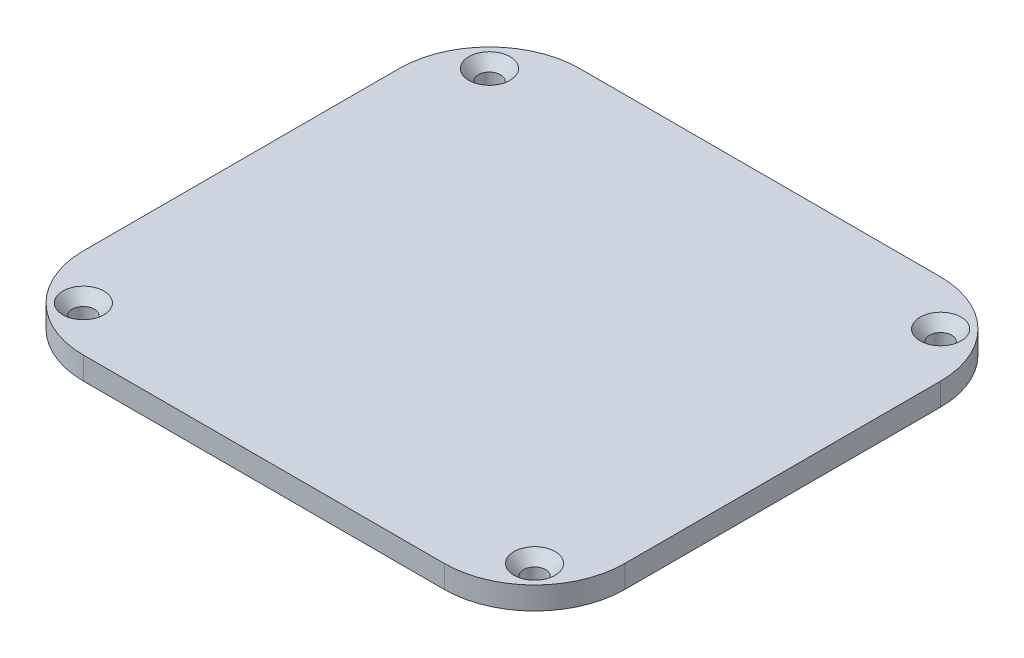
ISO-10303-21;
HEADER;
FILE_DESCRIPTION(('STEP AP214'),'2;1');
FILE_NAME('part.step','',(''),(''),'','','');
FILE_SCHEMA(('AUTOMOTIVE_DESIGN { 1 0 10303 214 1 1 1 1 }'));
ENDSEC;
DATA;
#1=APPLICATION_CONTEXT('core data for automotive mechanical design processes');
#2=APPLICATION_PROTOCOL_DEFINITION('international standard','automotive_design',2000,#1);
#3=PRODUCT_CONTEXT('',#1,'mechanical');
#4=PRODUCT('Part','Part','',(#3));
#5=PRODUCT_RELATED_PRODUCT_CATEGORY('part','',(#4));
#6=PRODUCT_DEFINITION_FORMATION('','',#4);
#7=PRODUCT_DEFINITION_CONTEXT('part definition',#1,'design');
#8=PRODUCT_DEFINITION('design','',#6,#7);
#9=PRODUCT_DEFINITION_SHAPE('','',#8);
#10=(LENGTH_UNIT() NAMED_UNIT(*) SI_UNIT(.MILLI.,.METRE.));
#11=(NAMED_UNIT(*) PLANE_ANGLE_UNIT() SI_UNIT($,.RADIAN.));
#12=(NAMED_UNIT(*) SI_UNIT($,.STERADIAN.) SOLID_ANGLE_UNIT());
#13=UNCERTAINTY_MEASURE_WITH_UNIT(LENGTH_MEASURE(1.E-05),#10,'distance_accuracy_value','');
#14=(GEOMETRIC_REPRESENTATION_CONTEXT(3) GLOBAL_UNCERTAINTY_ASSIGNED_CONTEXT((#13)) GLOBAL_UNIT_ASSIGNED_CONTEXT((#10,
#11,#12)) REPRESENTATION_CONTEXT('',''));
#15=CARTESIAN_POINT('',(0.,0.,0.));
#16=DIRECTION('',(0.,0.,1.));
#17=DIRECTION('',(1.,0.,0.));
#18=AXIS2_PLACEMENT_3D('',#15,#16,#17);
#19=CARTESIAN_POINT('',(-40.,0.,30.));
#20=DIRECTION('',(0.,-1.,0.));
#21=DIRECTION('',(0.,0.,-1.));
#22=AXIS2_PLACEMENT_3D('',#19,#20,#21);
#23=PLANE('',#22);
#24=CARTESIAN_POINT('',(50.,0.,40.));
#25=DIRECTION('',(0.,-1.,0.));
#26=DIRECTION('',(0.,0.,-1.));
#27=AXIS2_PLACEMENT_3D('',#24,#25,#26);
#28=CIRCLE('',#27,2.45744999999999);
#29=CARTESIAN_POINT('',(50.,0.,37.54255));
#30=VERTEX_POINT('',#29);
#31=EDGE_CURVE('E41',#30,#30,#28,.T.);
#32=ORIENTED_EDGE('',*,*,#31,.F.);
#33=EDGE_LOOP('',(#32));
#34=FACE_BOUND('',#33,.T.);
#35=CARTESIAN_POINT('',(50.,0.,-50.));
#36=DIRECTION('',(0.,-1.,0.));
#37=DIRECTION('',(0.,0.,-1.));
#38=AXIS2_PLACEMENT_3D('',#35,#36,#37);
#39=CIRCLE('',#38,2.45744999999999);
#40=CARTESIAN_POINT('',(50.,0.,-52.45745));
#41=VERTEX_POINT('',#40);
#42=EDGE_CURVE('E333',#41,#41,#39,.T.);
#43=ORIENTED_EDGE('',*,*,#42,.F.);
#44=EDGE_LOOP('',(#43));
#45=FACE_BOUND('',#44,.T.);
#46=CARTESIAN_POINT('',(-50.,0.,-50.));
#47=DIRECTION('',(0.,-1.,0.));
#48=DIRECTION('',(0.,0.,-1.));
#49=AXIS2_PLACEMENT_3D('',#46,#47,#48);
#50=CIRCLE('',#49,2.45744999999999);
#51=CARTESIAN_POINT('',(-50.,0.,-52.45745));
#52=VERTEX_POINT('',#51);
#53=EDGE_CURVE('E329',#52,#52,#50,.T.);
#54=ORIENTED_EDGE('',*,*,#53,.F.);
#55=EDGE_LOOP('',(#54));
#56=FACE_BOUND('',#55,.T.);
#57=CARTESIAN_POINT('',(-50.,0.,40.));
#58=DIRECTION('',(0.,-1.,0.));
#59=DIRECTION('',(0.,0.,-1.));
#60=AXIS2_PLACEMENT_3D('',#57,#58,#59);
#61=CIRCLE('',#60,2.45744999999999);
#62=CARTESIAN_POINT('',(-50.,0.,37.54255));
#63=VERTEX_POINT('',#62);
#64=EDGE_CURVE('E324',#63,#63,#61,.T.);
#65=ORIENTED_EDGE('',*,*,#64,.F.);
#66=EDGE_LOOP('',(#65));
#67=FACE_BOUND('',#66,.T.);
#68=CARTESIAN_POINT('',(27.44,0.,-12.83));
#69=DIRECTION('',(0.,-1.,0.));
#70=DIRECTION('',(0.,0.,-1.));
#71=AXIS2_PLACEMENT_3D('',#68,#69,#70);
#72=CIRCLE('',#71,4.9);
#73=CARTESIAN_POINT('',(27.44,0.,-17.73));
#74=VERTEX_POINT('',#73);
#75=EDGE_CURVE('E327',#74,#74,#72,.T.);
#76=ORIENTED_EDGE('',*,*,#75,.F.);
#77=EDGE_LOOP('',(#76));
#78=FACE_BOUND('',#77,.T.);
#79=CARTESIAN_POINT('',(44.41,0.,4.14000000000001));
#80=DIRECTION('',(0.,-1.,0.));
#81=DIRECTION('',(0.,0.,-1.));
#82=AXIS2_PLACEMENT_3D('',#79,#80,#81);
#83=CIRCLE('',#82,4.9);
#84=CARTESIAN_POINT('',(44.41,0.,-0.759999999999998));
#85=VERTEX_POINT('',#84);
#86=EDGE_CURVE('E359',#85,#85,#83,.T.);
#87=ORIENTED_EDGE('',*,*,#86,.F.);
#88=EDGE_LOOP('',(#87));
#89=FACE_BOUND('',#88,.T.);
#90=CARTESIAN_POINT('',(3.43999999999999,0.,-12.83));
#91=DIRECTION('',(0.,-1.,0.));
#92=DIRECTION('',(0.,0.,-1.));
#93=AXIS2_PLACEMENT_3D('',#90,#91,#92);
#94=CIRCLE('',#93,4.9);
#95=CARTESIAN_POINT('',(3.43999999999999,0.,-17.73));
#96=VERTEX_POINT('',#95);
#97=EDGE_CURVE('E365',#96,#96,#94,.T.);
#98=ORIENTED_EDGE('',*,*,#97,.F.);
#99=EDGE_LOOP('',(#98));
#100=FACE_BOUND('',#99,.T.);
#101=CARTESIAN_POINT('',(-43.84,0.,2.83));
#102=DIRECTION('',(0.,-1.,0.));
#103=DIRECTION('',(0.,0.,-1.));
#104=AXIS2_PLACEMENT_3D('',#101,#102,#103);
#105=CIRCLE('',#104,4.9);
#106=CARTESIAN_POINT('',(-43.84,0.,-2.07));
#107=VERTEX_POINT('',#106);
#108=EDGE_CURVE('E371',#107,#107,#105,.T.);
#109=ORIENTED_EDGE('',*,*,#108,.F.);
#110=EDGE_LOOP('',(#109));
#111=FACE_BOUND('',#110,.T.);
#112=CARTESIAN_POINT('',(-20.2,0.,7.00000000000001));
#113=DIRECTION('',(0.,-1.,0.));
#114=DIRECTION('',(0.,0.,-1.));
#115=AXIS2_PLACEMENT_3D('',#112,#113,#114);
#116=CIRCLE('',#115,4.9);
#117=CARTESIAN_POINT('',(-20.2,0.,2.1));
#118=VERTEX_POINT('',#117);
#119=EDGE_CURVE('E377',#118,#118,#116,.T.);
#120=ORIENTED_EDGE('',*,*,#119,.F.);
#121=EDGE_LOOP('',(#120));
#122=FACE_BOUND('',#121,.T.);
#123=DIRECTION('',(-1.,0.,0.));
#124=VECTOR('',#123,1.);
#125=CARTESIAN_POINT('',(40.,0.,50.));
#126=LINE('',#125,#124);
#127=CARTESIAN_POINT('',(40.,0.,50.));
#128=VERTEX_POINT('',#127);
#129=CARTESIAN_POINT('',(-40.,0.,50.));
#130=VERTEX_POINT('',#129);
#131=EDGE_CURVE('E253',#128,#130,#126,.T.);
#132=ORIENTED_EDGE('',*,*,#131,.T.);
#133=CARTESIAN_POINT('',(-40.,0.,30.));
#134=DIRECTION('',(0.,-1.,0.));
#135=DIRECTION('',(0.,0.,-1.));
#136=AXIS2_PLACEMENT_3D('',#133,#134,#135);
#137=CIRCLE('',#136,20.);
#138=CARTESIAN_POINT('',(-60.,0.,30.));
#139=VERTEX_POINT('',#138);
#140=EDGE_CURVE('E292',#130,#139,#137,.T.);
#141=ORIENTED_EDGE('',*,*,#140,.T.);
#142=DIRECTION('',(0.,0.,-1.));
#143=VECTOR('',#142,1.);
#144=CARTESIAN_POINT('',(-60.,0.,30.));
#145=LINE('',#144,#143);
#146=CARTESIAN_POINT('',(-60.,0.,-40.));
#147=VERTEX_POINT('',#146);
#148=EDGE_CURVE('E295',#139,#147,#145,.T.);
#149=ORIENTED_EDGE('',*,*,#148,.T.);
#150=CARTESIAN_POINT('',(-40.,0.,-40.));
#151=DIRECTION('',(0.,-1.,0.));
#152=DIRECTION('',(0.,0.,-1.));
#153=AXIS2_PLACEMENT_3D('',#150,#151,#152);
#154=CIRCLE('',#153,20.);
#155=CARTESIAN_POINT('',(-40.,0.,-60.));
#156=VERTEX_POINT('',#155);
#157=EDGE_CURVE('E298',#147,#156,#154,.T.);
#158=ORIENTED_EDGE('',*,*,#157,.T.);
#159=DIRECTION('',(1.,0.,0.));
#160=VECTOR('',#159,1.);
#161=CARTESIAN_POINT('',(-40.,0.,-60.));
#162=LINE('',#161,#160);
#163=CARTESIAN_POINT('',(40.,0.,-60.));
#164=VERTEX_POINT('',#163);
#165=EDGE_CURVE('E301',#156,#164,#162,.T.);
#166=ORIENTED_EDGE('',*,*,#165,.T.);
#167=CARTESIAN_POINT('',(40.,0.,-40.));
#168=DIRECTION('',(0.,1.,0.));
#169=DIRECTION('',(0.,0.,1.));
#170=AXIS2_PLACEMENT_3D('',#167,#168,#169);
#171=CIRCLE('',#170,20.);
#172=CARTESIAN_POINT('',(60.,0.,-40.));
#173=VERTEX_POINT('',#172);
#174=EDGE_CURVE('E304',#173,#164,#171,.T.);
#175=ORIENTED_EDGE('',*,*,#174,.F.);
#176=DIRECTION('',(0.,0.,1.));
#177=VECTOR('',#176,1.);
#178=CARTESIAN_POINT('',(60.,0.,-40.));
#179=LINE('',#178,#177);
#180=CARTESIAN_POINT('',(60.,0.,30.));
#181=VERTEX_POINT('',#180);
#182=EDGE_CURVE('E307',#173,#181,#179,.T.);
#183=ORIENTED_EDGE('',*,*,#182,.T.);
#184=CARTESIAN_POINT('',(40.,0.,30.));
#185=DIRECTION('',(0.,-1.,0.));
#186=DIRECTION('',(0.,0.,-1.));
#187=AXIS2_PLACEMENT_3D('',#184,#185,#186);
#188=CIRCLE('',#187,20.);
#189=EDGE_CURVE('E269',#181,#128,#188,.T.);
#190=ORIENTED_EDGE('',*,*,#189,.T.);
#191=EDGE_LOOP('',(#132,#141,#149,#158,#166,#175,#183,#190));
#192=FACE_BOUND('',#191,.T.);
#193=DIRECTION('',(1.,0.,0.));
#194=VECTOR('',#193,1.);
#195=CARTESIAN_POINT('',(0.,0.,-30.6));
#196=LINE('',#195,#194);
#197=CARTESIAN_POINT('',(3.09999999999999,0.,-30.6));
#198=VERTEX_POINT('',#197);
#199=CARTESIAN_POINT('',(41.9,0.,-30.6));
#200=VERTEX_POINT('',#199);
#201=EDGE_CURVE('E228',#198,#200,#196,.T.);
#202=ORIENTED_EDGE('',*,*,#201,.T.);
#203=DIRECTION('',(0.,0.,1.));
#204=VECTOR('',#203,1.);
#205=CARTESIAN_POINT('',(41.9,0.,0.));
#206=LINE('',#205,#204);
#207=CARTESIAN_POINT('',(41.9,0.,-43.));
#208=VERTEX_POINT('',#207);
#209=EDGE_CURVE('E215',#208,#200,#206,.T.);
#210=ORIENTED_EDGE('',*,*,#209,.F.);
#211=CARTESIAN_POINT('',(30.5,0.,-43.));
#212=DIRECTION('',(0.,1.,0.));
#213=DIRECTION('',(0.,0.,1.));
#214=AXIS2_PLACEMENT_3D('',#211,#212,#213);
#215=CIRCLE('',#214,11.4);
#216=CARTESIAN_POINT('',(30.5,0.,-54.4));
#217=VERTEX_POINT('',#216);
#218=EDGE_CURVE('E243',#208,#217,#215,.T.);
#219=ORIENTED_EDGE('',*,*,#218,.T.);
#220=DIRECTION('',(-1.,0.,0.));
#221=VECTOR('',#220,1.);
#222=CARTESIAN_POINT('',(0.,0.,-54.4));
#223=LINE('',#222,#221);
#224=CARTESIAN_POINT('',(3.09999999999999,0.,-54.4));
#225=VERTEX_POINT('',#224);
#226=EDGE_CURVE('E245',#217,#225,#223,.T.);
#227=ORIENTED_EDGE('',*,*,#226,.T.);
#228=DIRECTION('',(0.,0.,1.));
#229=VECTOR('',#228,1.);
#230=CARTESIAN_POINT('',(3.09999999999999,0.,0.));
#231=LINE('',#230,#229);
#232=EDGE_CURVE('E247',#225,#198,#231,.T.);
#233=ORIENTED_EDGE('',*,*,#232,.T.);
#234=EDGE_LOOP('',(#202,#210,#219,#227,#233));
#235=FACE_BOUND('',#234,.T.);
#236=DIRECTION('',(0.,0.,1.));
#237=VECTOR('',#236,1.);
#238=CARTESIAN_POINT('',(-39.4,0.,0.));
#239=LINE('',#238,#237);
#240=CARTESIAN_POINT('',(-39.4,0.,22.6));
#241=VERTEX_POINT('',#240);
#242=CARTESIAN_POINT('',(-39.4,0.,32.));
#243=VERTEX_POINT('',#242);
#244=EDGE_CURVE('E54',#241,#243,#239,.T.);
#245=ORIENTED_EDGE('',*,*,#244,.T.);
#246=CARTESIAN_POINT('',(-30.,0.,32.));
#247=DIRECTION('',(0.,1.,0.));
#248=DIRECTION('',(0.,0.,1.));
#249=AXIS2_PLACEMENT_3D('',#246,#247,#248);
#250=CIRCLE('',#249,9.4);
#251=CARTESIAN_POINT('',(-30.,0.,41.4));
#252=VERTEX_POINT('',#251);
#253=EDGE_CURVE('E202',#252,#243,#250,.F.);
#254=ORIENTED_EDGE('',*,*,#253,.F.);
#255=DIRECTION('',(1.,0.,0.));
#256=VECTOR('',#255,1.);
#257=CARTESIAN_POINT('',(0.,0.,41.4));
#258=LINE('',#257,#256);
#259=CARTESIAN_POINT('',(32.5,0.,41.4));
#260=VERTEX_POINT('',#259);
#261=EDGE_CURVE('E175',#252,#260,#258,.T.);
#262=ORIENTED_EDGE('',*,*,#261,.T.);
#263=CARTESIAN_POINT('',(32.5,0.,32.));
#264=DIRECTION('',(0.,1.,0.));
#265=DIRECTION('',(0.,0.,1.));
#266=AXIS2_PLACEMENT_3D('',#263,#264,#265);
#267=CIRCLE('',#266,9.40000000000001);
#268=CARTESIAN_POINT('',(41.9,0.,32.));
#269=VERTEX_POINT('',#268);
#270=EDGE_CURVE('E206',#269,#260,#267,.F.);
#271=ORIENTED_EDGE('',*,*,#270,.F.);
#272=DIRECTION('',(0.,0.,1.));
#273=VECTOR('',#272,1.);
#274=CARTESIAN_POINT('',(41.9,0.,0.));
#275=LINE('',#274,#273);
#276=CARTESIAN_POINT('',(41.9,0.,22.6));
#277=VERTEX_POINT('',#276);
#278=EDGE_CURVE('E209',#277,#269,#275,.T.);
#279=ORIENTED_EDGE('',*,*,#278,.F.);
#280=DIRECTION('',(1.,0.,0.));
#281=VECTOR('',#280,1.);
#282=CARTESIAN_POINT('',(0.,0.,22.6));
#283=LINE('',#282,#281);
#284=EDGE_CURVE('E59',#241,#277,#283,.T.);
#285=ORIENTED_EDGE('',*,*,#284,.F.);
#286=EDGE_LOOP('',(#245,#254,#262,#271,#279,#285));
#287=FACE_BOUND('',#286,.T.);
#288=ADVANCED_FACE('F37',(#34,#45,#56,#67,#78,#89,#100,#111,#122,#192,#235,#287),#23,.T.);
#289=CARTESIAN_POINT('',(40.,5.,50.));
#290=DIRECTION('',(0.,0.,1.));
#291=DIRECTION('',(1.,0.,0.));
#292=AXIS2_PLACEMENT_3D('',#289,#290,#291);
#293=PLANE('',#292);
#294=ORIENTED_EDGE('',*,*,#131,.F.);
#295=DIRECTION('',(0.,-1.,0.));
#296=VECTOR('',#295,1.);
#297=CARTESIAN_POINT('',(40.,5.,50.));
#298=LINE('',#297,#296);
#299=CARTESIAN_POINT('',(40.,5.,50.));
#300=VERTEX_POINT('',#299);
#301=EDGE_CURVE('E11',#300,#128,#298,.T.);
#302=ORIENTED_EDGE('',*,*,#301,.F.);
#303=DIRECTION('',(-1.,0.,0.));
#304=VECTOR('',#303,1.);
#305=CARTESIAN_POINT('',(40.,5.,50.));
#306=LINE('',#305,#304);
#307=CARTESIAN_POINT('',(-40.,5.,50.));
#308=VERTEX_POINT('',#307);
#309=EDGE_CURVE('E265',#300,#308,#306,.T.);
#310=ORIENTED_EDGE('',*,*,#309,.T.);
#311=DIRECTION('',(0.,-1.,0.));
#312=VECTOR('',#311,1.);
#313=CARTESIAN_POINT('',(-40.,5.,50.));
#314=LINE('',#313,#312);
#315=EDGE_CURVE('E289',#308,#130,#314,.T.);
#316=ORIENTED_EDGE('',*,*,#315,.T.);
#317=EDGE_LOOP('',(#294,#302,#310,#316));
#318=FACE_BOUND('',#317,.T.);
#319=ADVANCED_FACE('F39',(#318),#293,.T.);
#320=CARTESIAN_POINT('',(40.,5.,30.));
#321=DIRECTION('',(0.,-1.,0.));
#322=DIRECTION('',(0.,0.,-1.));
#323=AXIS2_PLACEMENT_3D('',#320,#321,#322);
#324=CYLINDRICAL_SURFACE('',#323,20.);
#325=ORIENTED_EDGE('',*,*,#189,.F.);
#326=DIRECTION('',(0.,-1.,0.));
#327=VECTOR('',#326,1.);
#328=CARTESIAN_POINT('',(60.,5.,30.));
#329=LINE('',#328,#327);
#330=CARTESIAN_POINT('',(60.,5.,30.));
#331=VERTEX_POINT('',#330);
#332=EDGE_CURVE('E46',#331,#181,#329,.T.);
#333=ORIENTED_EDGE('',*,*,#332,.F.);
#334=CARTESIAN_POINT('',(40.,5.,30.));
#335=DIRECTION('',(0.,-1.,0.));
#336=DIRECTION('',(0.,0.,-1.));
#337=AXIS2_PLACEMENT_3D('',#334,#335,#336);
#338=CIRCLE('',#337,20.);
#339=EDGE_CURVE('E286',#331,#300,#338,.T.);
#340=ORIENTED_EDGE('',*,*,#339,.T.);
#341=ORIENTED_EDGE('',*,*,#301,.T.);
#342=EDGE_LOOP('',(#325,#333,#340,#341));
#343=FACE_BOUND('',#342,.T.);
#344=ADVANCED_FACE('F438',(#343),#324,.T.);
#345=CARTESIAN_POINT('',(60.,5.,-40.));
#346=DIRECTION('',(1.,0.,0.));
#347=DIRECTION('',(0.,0.,-1.));
#348=AXIS2_PLACEMENT_3D('',#345,#346,#347);
#349=PLANE('',#348);
#350=ORIENTED_EDGE('',*,*,#182,.F.);
#351=DIRECTION('',(0.,-1.,0.));
#352=VECTOR('',#351,1.);
#353=CARTESIAN_POINT('',(60.,5.,-40.));
#354=LINE('',#353,#352);
#355=CARTESIAN_POINT('',(60.,5.,-40.));
#356=VERTEX_POINT('',#355);
#357=EDGE_CURVE('E313',#356,#173,#354,.T.);
#358=ORIENTED_EDGE('',*,*,#357,.F.);
#359=DIRECTION('',(0.,0.,1.));
#360=VECTOR('',#359,1.);
#361=CARTESIAN_POINT('',(60.,5.,-40.));
#362=LINE('',#361,#360);
#363=EDGE_CURVE('E283',#356,#331,#362,.T.);
#364=ORIENTED_EDGE('',*,*,#363,.T.);
#365=ORIENTED_EDGE('',*,*,#332,.T.);
#366=EDGE_LOOP('',(#350,#358,#364,#365));
#367=FACE_BOUND('',#366,.T.);
#368=ADVANCED_FACE('F441',(#367),#349,.T.);
#369=CARTESIAN_POINT('',(40.,5.,-40.));
#370=DIRECTION('',(0.,-1.,0.));
#371=DIRECTION('',(0.,0.,-1.));
#372=AXIS2_PLACEMENT_3D('',#369,#370,#371);
#373=CYLINDRICAL_SURFACE('',#372,20.);
#374=ORIENTED_EDGE('',*,*,#174,.T.);
#375=DIRECTION('',(0.,-1.,0.));
#376=VECTOR('',#375,1.);
#377=CARTESIAN_POINT('',(40.,5.,-60.));
#378=LINE('',#377,#376);
#379=CARTESIAN_POINT('',(40.,5.,-60.));
#380=VERTEX_POINT('',#379);
#381=EDGE_CURVE('E315',#380,#164,#378,.T.);
#382=ORIENTED_EDGE('',*,*,#381,.F.);
#383=CARTESIAN_POINT('',(40.,5.,-40.));
#384=DIRECTION('',(0.,1.,0.));
#385=DIRECTION('',(0.,0.,1.));
#386=AXIS2_PLACEMENT_3D('',#383,#384,#385);
#387=CIRCLE('',#386,20.);
#388=EDGE_CURVE('E281',#356,#380,#387,.T.);
#389=ORIENTED_EDGE('',*,*,#388,.F.);
#390=ORIENTED_EDGE('',*,*,#357,.T.);
#391=EDGE_LOOP('',(#374,#382,#389,#390));
#392=FACE_BOUND('',#391,.T.);
#393=ADVANCED_FACE('F445',(#392),#373,.T.);
#394=CARTESIAN_POINT('',(-40.,5.,-60.));
#395=DIRECTION('',(0.,0.,-1.));
#396=DIRECTION('',(-1.,0.,0.));
#397=AXIS2_PLACEMENT_3D('',#394,#395,#396);
#398=PLANE('',#397);
#399=ORIENTED_EDGE('',*,*,#165,.F.);
#400=DIRECTION('',(0.,-1.,0.));
#401=VECTOR('',#400,1.);
#402=CARTESIAN_POINT('',(-40.,5.,-60.));
#403=LINE('',#402,#401);
#404=CARTESIAN_POINT('',(-40.,5.,-60.));
#405=VERTEX_POINT('',#404);
#406=EDGE_CURVE('E317',#405,#156,#403,.T.);
#407=ORIENTED_EDGE('',*,*,#406,.F.);
#408=DIRECTION('',(1.,0.,0.));
#409=VECTOR('',#408,1.);
#410=CARTESIAN_POINT('',(-40.,5.,-60.));
#411=LINE('',#410,#409);
#412=EDGE_CURVE('E278',#405,#380,#411,.T.);
#413=ORIENTED_EDGE('',*,*,#412,.T.);
#414=ORIENTED_EDGE('',*,*,#381,.T.);
#415=EDGE_LOOP('',(#399,#407,#413,#414));
#416=FACE_BOUND('',#415,.T.);
#417=ADVANCED_FACE('F449',(#416),#398,.T.);
#418=CARTESIAN_POINT('',(-40.,5.,-40.));
#419=DIRECTION('',(0.,-1.,0.));
#420=DIRECTION('',(0.,0.,-1.));
#421=AXIS2_PLACEMENT_3D('',#418,#419,#420);
#422=CYLINDRICAL_SURFACE('',#421,20.);
#423=ORIENTED_EDGE('',*,*,#157,.F.);
#424=DIRECTION('',(0.,-1.,0.));
#425=VECTOR('',#424,1.);
#426=CARTESIAN_POINT('',(-60.,5.,-40.));
#427=LINE('',#426,#425);
#428=CARTESIAN_POINT('',(-60.,5.,-40.));
#429=VERTEX_POINT('',#428);
#430=EDGE_CURVE('E319',#429,#147,#427,.T.);
#431=ORIENTED_EDGE('',*,*,#430,.F.);
#432=CARTESIAN_POINT('',(-40.,5.,-40.));
#433=DIRECTION('',(0.,-1.,0.));
#434=DIRECTION('',(0.,0.,-1.));
#435=AXIS2_PLACEMENT_3D('',#432,#433,#434);
#436=CIRCLE('',#435,20.);
#437=EDGE_CURVE('E275',#429,#405,#436,.T.);
#438=ORIENTED_EDGE('',*,*,#437,.T.);
#439=ORIENTED_EDGE('',*,*,#406,.T.);
#440=EDGE_LOOP('',(#423,#431,#438,#439));
#441=FACE_BOUND('',#440,.T.);
#442=ADVANCED_FACE('F453',(#441),#422,.T.);
#443=CARTESIAN_POINT('',(-60.,5.,30.));
#444=DIRECTION('',(-1.,0.,0.));
#445=DIRECTION('',(0.,0.,1.));
#446=AXIS2_PLACEMENT_3D('',#443,#444,#445);
#447=PLANE('',#446);
#448=ORIENTED_EDGE('',*,*,#148,.F.);
#449=DIRECTION('',(0.,-1.,0.));
#450=VECTOR('',#449,1.);
#451=CARTESIAN_POINT('',(-60.,5.,30.));
#452=LINE('',#451,#450);
#453=CARTESIAN_POINT('',(-60.,5.,30.));
#454=VERTEX_POINT('',#453);
#455=EDGE_CURVE('E321',#454,#139,#452,.T.);
#456=ORIENTED_EDGE('',*,*,#455,.F.);
#457=DIRECTION('',(0.,0.,-1.));
#458=VECTOR('',#457,1.);
#459=CARTESIAN_POINT('',(-60.,5.,30.));
#460=LINE('',#459,#458);
#461=EDGE_CURVE('E272',#454,#429,#460,.T.);
#462=ORIENTED_EDGE('',*,*,#461,.T.);
#463=ORIENTED_EDGE('',*,*,#430,.T.);
#464=EDGE_LOOP('',(#448,#456,#462,#463));
#465=FACE_BOUND('',#464,.T.);
#466=ADVANCED_FACE('F457',(#465),#447,.T.);
#467=CARTESIAN_POINT('',(-40.,5.,30.));
#468=DIRECTION('',(0.,-1.,0.));
#469=DIRECTION('',(0.,0.,-1.));
#470=AXIS2_PLACEMENT_3D('',#467,#468,#469);
#471=CYLINDRICAL_SURFACE('',#470,20.);
#472=ORIENTED_EDGE('',*,*,#140,.F.);
#473=ORIENTED_EDGE('',*,*,#315,.F.);
#474=CARTESIAN_POINT('',(-40.,5.,30.));
#475=DIRECTION('',(0.,-1.,0.));
#476=DIRECTION('',(0.,0.,-1.));
#477=AXIS2_PLACEMENT_3D('',#474,#475,#476);
#478=CIRCLE('',#477,20.);
#479=EDGE_CURVE('E268',#308,#454,#478,.T.);
#480=ORIENTED_EDGE('',*,*,#479,.T.);
#481=ORIENTED_EDGE('',*,*,#455,.T.);
#482=EDGE_LOOP('',(#472,#473,#480,#481));
#483=FACE_BOUND('',#482,.T.);
#484=ADVANCED_FACE('F435',(#483),#471,.T.);
#485=CARTESIAN_POINT('',(-40.,5.,30.));
#486=DIRECTION('',(0.,-1.,0.));
#487=DIRECTION('',(0.,0.,-1.));
#488=AXIS2_PLACEMENT_3D('',#485,#486,#487);
#489=PLANE('',#488);
#490=CARTESIAN_POINT('',(50.,5.,40.));
#491=DIRECTION('',(0.,1.,0.));
#492=DIRECTION('',(0.,0.,1.));
#493=AXIS2_PLACEMENT_3D('',#490,#491,#492);
#494=CIRCLE('',#493,4.5593);
#495=CARTESIAN_POINT('',(50.,5.,44.5593));
#496=VERTEX_POINT('',#495);
#497=EDGE_CURVE('E808',#496,#496,#494,.T.);
#498=ORIENTED_EDGE('',*,*,#497,.F.);
#499=EDGE_LOOP('',(#498));
#500=FACE_BOUND('',#499,.T.);
#501=CARTESIAN_POINT('',(50.,5.,-50.));
#502=DIRECTION('',(0.,1.,0.));
#503=DIRECTION('',(0.,0.,1.));
#504=AXIS2_PLACEMENT_3D('',#501,#502,#503);
#505=CIRCLE('',#504,4.5593);
#506=CARTESIAN_POINT('',(50.,5.,-45.4407));
#507=VERTEX_POINT('',#506);
#508=EDGE_CURVE('E342',#507,#507,#505,.T.);
#509=ORIENTED_EDGE('',*,*,#508,.F.);
#510=EDGE_LOOP('',(#509));
#511=FACE_BOUND('',#510,.T.);
#512=CARTESIAN_POINT('',(-50.,5.,-50.));
#513=DIRECTION('',(0.,1.,0.));
#514=DIRECTION('',(0.,0.,1.));
#515=AXIS2_PLACEMENT_3D('',#512,#513,#514);
#516=CIRCLE('',#515,4.5593);
#517=CARTESIAN_POINT('',(-50.,5.,-45.4407));
#518=VERTEX_POINT('',#517);
#519=EDGE_CURVE('E335',#518,#518,#516,.T.);
#520=ORIENTED_EDGE('',*,*,#519,.F.);
#521=EDGE_LOOP('',(#520));
#522=FACE_BOUND('',#521,.T.);
#523=CARTESIAN_POINT('',(-50.,5.,40.));
#524=DIRECTION('',(0.,1.,0.));
#525=DIRECTION('',(0.,0.,1.));
#526=AXIS2_PLACEMENT_3D('',#523,#524,#525);
#527=CIRCLE('',#526,4.5593);
#528=CARTESIAN_POINT('',(-50.,5.,44.5593));
#529=VERTEX_POINT('',#528);
#530=EDGE_CURVE('E331',#529,#529,#527,.T.);
#531=ORIENTED_EDGE('',*,*,#530,.F.);
#532=EDGE_LOOP('',(#531));
#533=FACE_BOUND('',#532,.T.);
#534=ORIENTED_EDGE('',*,*,#309,.F.);
#535=ORIENTED_EDGE('',*,*,#339,.F.);
#536=ORIENTED_EDGE('',*,*,#363,.F.);
#537=ORIENTED_EDGE('',*,*,#388,.T.);
#538=ORIENTED_EDGE('',*,*,#412,.F.);
#539=ORIENTED_EDGE('',*,*,#437,.F.);
#540=ORIENTED_EDGE('',*,*,#461,.F.);
#541=ORIENTED_EDGE('',*,*,#479,.F.);
#542=EDGE_LOOP('',(#534,#535,#536,#537,#538,#539,#540,#541));
#543=FACE_BOUND('',#542,.T.);
#544=ADVANCED_FACE('F433',(#500,#511,#522,#533,#543),#489,.F.);
#545=CARTESIAN_POINT('',(41.9,-4.4,0.));
#546=DIRECTION('',(-1.,0.,0.));
#547=DIRECTION('',(0.,0.,1.));
#548=AXIS2_PLACEMENT_3D('',#545,#546,#547);
#549=PLANE('',#548);
#550=ORIENTED_EDGE('',*,*,#209,.T.);
#551=DIRECTION('',(0.,1.,0.));
#552=VECTOR('',#551,1.);
#553=CARTESIAN_POINT('',(41.9,-4.4,-30.6));
#554=LINE('',#553,#552);
#555=CARTESIAN_POINT('',(41.9,-4.4,-30.6));
#556=VERTEX_POINT('',#555);
#557=EDGE_CURVE('E250',#556,#200,#554,.T.);
#558=ORIENTED_EDGE('',*,*,#557,.F.);
#559=DIRECTION('',(0.,0.,1.));
#560=VECTOR('',#559,1.);
#561=CARTESIAN_POINT('',(41.9,-4.4,0.));
#562=LINE('',#561,#560);
#563=CARTESIAN_POINT('',(41.9,-4.4,-43.));
#564=VERTEX_POINT('',#563);
#565=EDGE_CURVE('E225',#564,#556,#562,.T.);
#566=ORIENTED_EDGE('',*,*,#565,.F.);
#567=DIRECTION('',(0.,1.,0.));
#568=VECTOR('',#567,1.);
#569=CARTESIAN_POINT('',(41.9,-4.4,-43.));
#570=LINE('',#569,#568);
#571=EDGE_CURVE('E240',#564,#208,#570,.T.);
#572=ORIENTED_EDGE('',*,*,#571,.T.);
#573=EDGE_LOOP('',(#550,#558,#566,#572));
#574=FACE_BOUND('',#573,.T.);
#575=ADVANCED_FACE('F400',(#574),#549,.F.);
#576=CARTESIAN_POINT('',(0.,-4.4,-30.6));
#577=DIRECTION('',(0.,0.,1.));
#578=DIRECTION('',(1.,0.,0.));
#579=AXIS2_PLACEMENT_3D('',#576,#577,#578);
#580=PLANE('',#579);
#581=ORIENTED_EDGE('',*,*,#201,.F.);
#582=DIRECTION('',(0.,1.,0.));
#583=VECTOR('',#582,1.);
#584=CARTESIAN_POINT('',(3.09999999999999,-4.4,-30.6));
#585=LINE('',#584,#583);
#586=CARTESIAN_POINT('',(3.09999999999999,-4.4,-30.6));
#587=VERTEX_POINT('',#586);
#588=EDGE_CURVE('E254',#587,#198,#585,.T.);
#589=ORIENTED_EDGE('',*,*,#588,.F.);
#590=DIRECTION('',(1.,0.,0.));
#591=VECTOR('',#590,1.);
#592=CARTESIAN_POINT('',(0.,-4.4,-30.6));
#593=LINE('',#592,#591);
#594=EDGE_CURVE('E237',#587,#556,#593,.T.);
#595=ORIENTED_EDGE('',*,*,#594,.T.);
#596=ORIENTED_EDGE('',*,*,#557,.T.);
#597=EDGE_LOOP('',(#581,#589,#595,#596));
#598=FACE_BOUND('',#597,.T.);
#599=ADVANCED_FACE('F396',(#598),#580,.T.);
#600=CARTESIAN_POINT('',(3.09999999999999,-4.4,0.));
#601=DIRECTION('',(-1.,0.,0.));
#602=DIRECTION('',(0.,0.,1.));
#603=AXIS2_PLACEMENT_3D('',#600,#601,#602);
#604=PLANE('',#603);
#605=ORIENTED_EDGE('',*,*,#232,.F.);
#606=DIRECTION('',(0.,1.,0.));
#607=VECTOR('',#606,1.);
#608=CARTESIAN_POINT('',(3.09999999999999,-4.4,-54.4));
#609=LINE('',#608,#607);
#610=CARTESIAN_POINT('',(3.09999999999999,-4.4,-54.4));
#611=VERTEX_POINT('',#610);
#612=EDGE_CURVE('E257',#611,#225,#609,.T.);
#613=ORIENTED_EDGE('',*,*,#612,.F.);
#614=DIRECTION('',(0.,0.,1.));
#615=VECTOR('',#614,1.);
#616=CARTESIAN_POINT('',(3.09999999999999,-4.4,0.));
#617=LINE('',#616,#615);
#618=EDGE_CURVE('E234',#611,#587,#617,.T.);
#619=ORIENTED_EDGE('',*,*,#618,.T.);
#620=ORIENTED_EDGE('',*,*,#588,.T.);
#621=EDGE_LOOP('',(#605,#613,#619,#620));
#622=FACE_BOUND('',#621,.T.);
#623=ADVANCED_FACE('F411',(#622),#604,.T.);
#624=CARTESIAN_POINT('',(0.,-4.4,-54.4));
#625=DIRECTION('',(0.,0.,-1.));
#626=DIRECTION('',(-1.,0.,0.));
#627=AXIS2_PLACEMENT_3D('',#624,#625,#626);
#628=PLANE('',#627);
#629=ORIENTED_EDGE('',*,*,#226,.F.);
#630=DIRECTION('',(0.,1.,0.));
#631=VECTOR('',#630,1.);
#632=CARTESIAN_POINT('',(30.5,-4.4,-54.4));
#633=LINE('',#632,#631);
#634=CARTESIAN_POINT('',(30.5,-4.4,-54.4));
#635=VERTEX_POINT('',#634);
#636=EDGE_CURVE('E260',#635,#217,#633,.T.);
#637=ORIENTED_EDGE('',*,*,#636,.F.);
#638=DIRECTION('',(-1.,0.,0.));
#639=VECTOR('',#638,1.);
#640=CARTESIAN_POINT('',(0.,-4.4,-54.4));
#641=LINE('',#640,#639);
#642=EDGE_CURVE('E231',#635,#611,#641,.T.);
#643=ORIENTED_EDGE('',*,*,#642,.T.);
#644=ORIENTED_EDGE('',*,*,#612,.T.);
#645=EDGE_LOOP('',(#629,#637,#643,#644));
#646=FACE_BOUND('',#645,.T.);
#647=ADVANCED_FACE('F407',(#646),#628,.T.);
#648=CARTESIAN_POINT('',(30.5,-4.4,-43.));
#649=DIRECTION('',(0.,1.,0.));
#650=DIRECTION('',(0.,0.,1.));
#651=AXIS2_PLACEMENT_3D('',#648,#649,#650);
#652=CYLINDRICAL_SURFACE('',#651,11.4);
#653=ORIENTED_EDGE('',*,*,#218,.F.);
#654=ORIENTED_EDGE('',*,*,#571,.F.);
#655=CARTESIAN_POINT('',(30.5,-4.4,-43.));
#656=DIRECTION('',(0.,1.,0.));
#657=DIRECTION('',(0.,0.,1.));
#658=AXIS2_PLACEMENT_3D('',#655,#656,#657);
#659=CIRCLE('',#658,11.4);
#660=EDGE_CURVE('E227',#564,#635,#659,.T.);
#661=ORIENTED_EDGE('',*,*,#660,.T.);
#662=ORIENTED_EDGE('',*,*,#636,.T.);
#663=EDGE_LOOP('',(#653,#654,#661,#662));
#664=FACE_BOUND('',#663,.T.);
#665=ADVANCED_FACE('F404',(#664),#652,.T.);
#666=CARTESIAN_POINT('',(0.,-4.4,0.));
#667=DIRECTION('',(0.,1.,0.));
#668=DIRECTION('',(0.,0.,1.));
#669=AXIS2_PLACEMENT_3D('',#666,#667,#668);
#670=PLANE('',#669);
#671=ORIENTED_EDGE('',*,*,#565,.T.);
#672=ORIENTED_EDGE('',*,*,#594,.F.);
#673=ORIENTED_EDGE('',*,*,#618,.F.);
#674=ORIENTED_EDGE('',*,*,#642,.F.);
#675=ORIENTED_EDGE('',*,*,#660,.F.);
#676=EDGE_LOOP('',(#671,#672,#673,#674,#675));
#677=FACE_BOUND('',#676,.T.);
#678=ADVANCED_FACE('F413',(#677),#670,.F.);
#679=CARTESIAN_POINT('',(-30.,-4.4,32.));
#680=DIRECTION('',(0.,1.,0.));
#681=DIRECTION('',(0.,0.,1.));
#682=AXIS2_PLACEMENT_3D('',#679,#680,#681);
#683=CYLINDRICAL_SURFACE('',#682,9.4);
#684=ORIENTED_EDGE('',*,*,#253,.T.);
#685=DIRECTION('',(0.,1.,0.));
#686=VECTOR('',#685,1.);
#687=CARTESIAN_POINT('',(-39.4,-4.4,32.));
#688=LINE('',#687,#686);
#689=CARTESIAN_POINT('',(-39.4,-4.4,32.));
#690=VERTEX_POINT('',#689);
#691=EDGE_CURVE('E184',#690,#243,#688,.T.);
#692=ORIENTED_EDGE('',*,*,#691,.F.);
#693=CARTESIAN_POINT('',(-30.,-4.4,32.));
#694=DIRECTION('',(0.,1.,0.));
#695=DIRECTION('',(0.,0.,1.));
#696=AXIS2_PLACEMENT_3D('',#693,#694,#695);
#697=CIRCLE('',#696,9.4);
#698=CARTESIAN_POINT('',(-30.,-4.4,41.4));
#699=VERTEX_POINT('',#698);
#700=EDGE_CURVE('E182',#699,#690,#697,.F.);
#701=ORIENTED_EDGE('',*,*,#700,.F.);
#702=DIRECTION('',(0.,1.,0.));
#703=VECTOR('',#702,1.);
#704=CARTESIAN_POINT('',(-30.,-4.4,41.4));
#705=LINE('',#704,#703);
#706=EDGE_CURVE('E169',#699,#252,#705,.T.);
#707=ORIENTED_EDGE('',*,*,#706,.T.);
#708=EDGE_LOOP('',(#684,#692,#701,#707));
#709=FACE_BOUND('',#708,.T.);
#710=ADVANCED_FACE('F183',(#709),#683,.T.);
#711=CARTESIAN_POINT('',(-39.4,-4.4,0.));
#712=DIRECTION('',(-1.,0.,0.));
#713=DIRECTION('',(0.,0.,1.));
#714=AXIS2_PLACEMENT_3D('',#711,#712,#713);
#715=PLANE('',#714);
#716=ORIENTED_EDGE('',*,*,#244,.F.);
#717=DIRECTION('',(0.,1.,0.));
#718=VECTOR('',#717,1.);
#719=CARTESIAN_POINT('',(-39.4,-4.4,22.6));
#720=LINE('',#719,#718);
#721=CARTESIAN_POINT('',(-39.4,-4.4,22.6));
#722=VERTEX_POINT('',#721);
#723=EDGE_CURVE('E216',#722,#241,#720,.T.);
#724=ORIENTED_EDGE('',*,*,#723,.F.);
#725=DIRECTION('',(0.,0.,1.));
#726=VECTOR('',#725,1.);
#727=CARTESIAN_POINT('',(-39.4,-4.4,0.));
#728=LINE('',#727,#726);
#729=EDGE_CURVE('E179',#722,#690,#728,.T.);
#730=ORIENTED_EDGE('',*,*,#729,.T.);
#731=ORIENTED_EDGE('',*,*,#691,.T.);
#732=EDGE_LOOP('',(#716,#724,#730,#731));
#733=FACE_BOUND('',#732,.T.);
#734=ADVANCED_FACE('F420',(#733),#715,.T.);
#735=CARTESIAN_POINT('',(0.,-4.4,22.6));
#736=DIRECTION('',(0.,0.,1.));
#737=DIRECTION('',(1.,0.,0.));
#738=AXIS2_PLACEMENT_3D('',#735,#736,#737);
#739=PLANE('',#738);
#740=ORIENTED_EDGE('',*,*,#284,.T.);
#741=DIRECTION('',(0.,1.,0.));
#742=VECTOR('',#741,1.);
#743=CARTESIAN_POINT('',(41.9,-4.4,22.6));
#744=LINE('',#743,#742);
#745=CARTESIAN_POINT('',(41.9,-4.4,22.6));
#746=VERTEX_POINT('',#745);
#747=EDGE_CURVE('E218',#746,#277,#744,.T.);
#748=ORIENTED_EDGE('',*,*,#747,.F.);
#749=DIRECTION('',(1.,0.,0.));
#750=VECTOR('',#749,1.);
#751=CARTESIAN_POINT('',(0.,-4.4,22.6));
#752=LINE('',#751,#750);
#753=EDGE_CURVE('E199',#722,#746,#752,.T.);
#754=ORIENTED_EDGE('',*,*,#753,.F.);
#755=ORIENTED_EDGE('',*,*,#723,.T.);
#756=EDGE_LOOP('',(#740,#748,#754,#755));
#757=FACE_BOUND('',#756,.T.);
#758=ADVANCED_FACE('F567',(#757),#739,.F.);
#759=CARTESIAN_POINT('',(41.9,-4.4,0.));
#760=DIRECTION('',(-1.,0.,0.));
#761=DIRECTION('',(0.,0.,1.));
#762=AXIS2_PLACEMENT_3D('',#759,#760,#761);
#763=PLANE('',#762);
#764=ORIENTED_EDGE('',*,*,#278,.T.);
#765=DIRECTION('',(0.,1.,0.));
#766=VECTOR('',#765,1.);
#767=CARTESIAN_POINT('',(41.9,-4.4,32.));
#768=LINE('',#767,#766);
#769=CARTESIAN_POINT('',(41.9,-4.4,32.));
#770=VERTEX_POINT('',#769);
#771=EDGE_CURVE('E221',#770,#269,#768,.T.);
#772=ORIENTED_EDGE('',*,*,#771,.F.);
#773=DIRECTION('',(0.,0.,1.));
#774=VECTOR('',#773,1.);
#775=CARTESIAN_POINT('',(41.9,-4.4,0.));
#776=LINE('',#775,#774);
#777=EDGE_CURVE('E194',#746,#770,#776,.T.);
#778=ORIENTED_EDGE('',*,*,#777,.F.);
#779=ORIENTED_EDGE('',*,*,#747,.T.);
#780=EDGE_LOOP('',(#764,#772,#778,#779));
#781=FACE_BOUND('',#780,.T.);
#782=ADVANCED_FACE('F577',(#781),#763,.F.);
#783=CARTESIAN_POINT('',(32.5,-4.4,32.));
#784=DIRECTION('',(0.,1.,0.));
#785=DIRECTION('',(0.,0.,1.));
#786=AXIS2_PLACEMENT_3D('',#783,#784,#785);
#787=CYLINDRICAL_SURFACE('',#786,9.40000000000001);
#788=ORIENTED_EDGE('',*,*,#270,.T.);
#789=DIRECTION('',(0.,1.,0.));
#790=VECTOR('',#789,1.);
#791=CARTESIAN_POINT('',(32.5,-4.4,41.4));
#792=LINE('',#791,#790);
#793=CARTESIAN_POINT('',(32.5,-4.4,41.4));
#794=VERTEX_POINT('',#793);
#795=EDGE_CURVE('E178',#794,#260,#792,.T.);
#796=ORIENTED_EDGE('',*,*,#795,.F.);
#797=CARTESIAN_POINT('',(32.5,-4.4,32.));
#798=DIRECTION('',(0.,1.,0.));
#799=DIRECTION('',(0.,0.,1.));
#800=AXIS2_PLACEMENT_3D('',#797,#798,#799);
#801=CIRCLE('',#800,9.40000000000001);
#802=EDGE_CURVE('E191',#770,#794,#801,.F.);
#803=ORIENTED_EDGE('',*,*,#802,.F.);
#804=ORIENTED_EDGE('',*,*,#771,.T.);
#805=EDGE_LOOP('',(#788,#796,#803,#804));
#806=FACE_BOUND('',#805,.T.);
#807=ADVANCED_FACE('F587',(#806),#787,.T.);
#808=CARTESIAN_POINT('',(0.,-4.4,41.4));
#809=DIRECTION('',(0.,0.,1.));
#810=DIRECTION('',(1.,0.,0.));
#811=AXIS2_PLACEMENT_3D('',#808,#809,#810);
#812=PLANE('',#811);
#813=ORIENTED_EDGE('',*,*,#261,.F.);
#814=ORIENTED_EDGE('',*,*,#706,.F.);
#815=DIRECTION('',(1.,0.,0.));
#816=VECTOR('',#815,1.);
#817=CARTESIAN_POINT('',(0.,-4.4,41.4));
#818=LINE('',#817,#816);
#819=EDGE_CURVE('E174',#699,#794,#818,.T.);
#820=ORIENTED_EDGE('',*,*,#819,.T.);
#821=ORIENTED_EDGE('',*,*,#795,.T.);
#822=EDGE_LOOP('',(#813,#814,#820,#821));
#823=FACE_BOUND('',#822,.T.);
#824=ADVANCED_FACE('F171',(#823),#812,.T.);
#825=CARTESIAN_POINT('',(0.,-4.4,0.));
#826=DIRECTION('',(0.,1.,0.));
#827=DIRECTION('',(0.,0.,1.));
#828=AXIS2_PLACEMENT_3D('',#825,#826,#827);
#829=PLANE('',#828);
#830=ORIENTED_EDGE('',*,*,#700,.T.);
#831=ORIENTED_EDGE('',*,*,#729,.F.);
#832=ORIENTED_EDGE('',*,*,#753,.T.);
#833=ORIENTED_EDGE('',*,*,#777,.T.);
#834=ORIENTED_EDGE('',*,*,#802,.T.);
#835=ORIENTED_EDGE('',*,*,#819,.F.);
#836=EDGE_LOOP('',(#830,#831,#832,#833,#834,#835));
#837=FACE_BOUND('',#836,.T.);
#838=ADVANCED_FACE('F189',(#837),#829,.F.);
#839=CARTESIAN_POINT('',(-20.2,1.5,7.00000000000001));
#840=DIRECTION('',(0.,-1.,0.));
#841=DIRECTION('',(0.,0.,-1.));
#842=AXIS2_PLACEMENT_3D('',#839,#840,#841);
#843=CYLINDRICAL_SURFACE('',#842,4.9);
#844=CARTESIAN_POINT('',(-20.2,1.5,7.00000000000001));
#845=DIRECTION('',(0.,-1.,0.));
#846=DIRECTION('',(0.,0.,-1.));
#847=AXIS2_PLACEMENT_3D('',#844,#845,#846);
#848=CIRCLE('',#847,4.9);
#849=CARTESIAN_POINT('',(-20.2,1.5,2.1));
#850=VERTEX_POINT('',#849);
#851=EDGE_CURVE('E204',#850,#850,#848,.T.);
#852=ORIENTED_EDGE('',*,*,#851,.F.);
#853=EDGE_LOOP('',(#852));
#854=FACE_BOUND('',#853,.T.);
#855=ORIENTED_EDGE('',*,*,#119,.T.);
#856=EDGE_LOOP('',(#855));
#857=FACE_BOUND('',#856,.T.);
#858=ADVANCED_FACE('F384',(#854,#857),#843,.F.);
#859=CARTESIAN_POINT('',(-20.2,1.5,7.00000000000001));
#860=DIRECTION('',(0.,-1.,0.));
#861=DIRECTION('',(0.,0.,-1.));
#862=AXIS2_PLACEMENT_3D('',#859,#860,#861);
#863=PLANE('',#862);
#864=ORIENTED_EDGE('',*,*,#851,.T.);
#865=EDGE_LOOP('',(#864));
#866=FACE_BOUND('',#865,.T.);
#867=ADVANCED_FACE('F621',(#866),#863,.T.);
#868=CARTESIAN_POINT('',(-43.84,1.5,2.83));
#869=DIRECTION('',(0.,-1.,0.));
#870=DIRECTION('',(0.,0.,-1.));
#871=AXIS2_PLACEMENT_3D('',#868,#869,#870);
#872=CYLINDRICAL_SURFACE('',#871,4.9);
#873=CARTESIAN_POINT('',(-43.84,1.5,2.83));
#874=DIRECTION('',(0.,-1.,0.));
#875=DIRECTION('',(0.,0.,-1.));
#876=AXIS2_PLACEMENT_3D('',#873,#874,#875);
#877=CIRCLE('',#876,4.9);
#878=CARTESIAN_POINT('',(-43.84,1.5,-2.07));
#879=VERTEX_POINT('',#878);
#880=EDGE_CURVE('E374',#879,#879,#877,.T.);
#881=ORIENTED_EDGE('',*,*,#880,.F.);
#882=EDGE_LOOP('',(#881));
#883=FACE_BOUND('',#882,.T.);
#884=ORIENTED_EDGE('',*,*,#108,.T.);
#885=EDGE_LOOP('',(#884));
#886=FACE_BOUND('',#885,.T.);
#887=ADVANCED_FACE('F631',(#883,#886),#872,.F.);
#888=CARTESIAN_POINT('',(-43.84,1.5,2.83));
#889=DIRECTION('',(0.,-1.,0.));
#890=DIRECTION('',(0.,0.,-1.));
#891=AXIS2_PLACEMENT_3D('',#888,#889,#890);
#892=PLANE('',#891);
#893=ORIENTED_EDGE('',*,*,#880,.T.);
#894=EDGE_LOOP('',(#893));
#895=FACE_BOUND('',#894,.T.);
#896=ADVANCED_FACE('F641',(#895),#892,.T.);
#897=CARTESIAN_POINT('',(3.43999999999999,1.5,-12.83));
#898=DIRECTION('',(0.,-1.,0.));
#899=DIRECTION('',(0.,0.,-1.));
#900=AXIS2_PLACEMENT_3D('',#897,#898,#899);
#901=CYLINDRICAL_SURFACE('',#900,4.9);
#902=CARTESIAN_POINT('',(3.43999999999999,1.5,-12.83));
#903=DIRECTION('',(0.,-1.,0.));
#904=DIRECTION('',(0.,0.,-1.));
#905=AXIS2_PLACEMENT_3D('',#902,#903,#904);
#906=CIRCLE('',#905,4.9);
#907=CARTESIAN_POINT('',(3.43999999999999,1.5,-17.73));
#908=VERTEX_POINT('',#907);
#909=EDGE_CURVE('E368',#908,#908,#906,.T.);
#910=ORIENTED_EDGE('',*,*,#909,.F.);
#911=EDGE_LOOP('',(#910));
#912=FACE_BOUND('',#911,.T.);
#913=ORIENTED_EDGE('',*,*,#97,.T.);
#914=EDGE_LOOP('',(#913));
#915=FACE_BOUND('',#914,.T.);
#916=ADVANCED_FACE('F651',(#912,#915),#901,.F.);
#917=CARTESIAN_POINT('',(3.43999999999999,1.5,-12.83));
#918=DIRECTION('',(0.,-1.,0.));
#919=DIRECTION('',(0.,0.,-1.));
#920=AXIS2_PLACEMENT_3D('',#917,#918,#919);
#921=PLANE('',#920);
#922=ORIENTED_EDGE('',*,*,#909,.T.);
#923=EDGE_LOOP('',(#922));
#924=FACE_BOUND('',#923,.T.);
#925=ADVANCED_FACE('F661',(#924),#921,.T.);
#926=CARTESIAN_POINT('',(44.41,1.5,4.14000000000001));
#927=DIRECTION('',(0.,-1.,0.));
#928=DIRECTION('',(0.,0.,-1.));
#929=AXIS2_PLACEMENT_3D('',#926,#927,#928);
#930=CYLINDRICAL_SURFACE('',#929,4.9);
#931=CARTESIAN_POINT('',(44.41,1.5,4.14000000000001));
#932=DIRECTION('',(0.,-1.,0.));
#933=DIRECTION('',(0.,0.,-1.));
#934=AXIS2_PLACEMENT_3D('',#931,#932,#933);
#935=CIRCLE('',#934,4.9);
#936=CARTESIAN_POINT('',(44.41,1.5,-0.759999999999998));
#937=VERTEX_POINT('',#936);
#938=EDGE_CURVE('E362',#937,#937,#935,.T.);
#939=ORIENTED_EDGE('',*,*,#938,.F.);
#940=EDGE_LOOP('',(#939));
#941=FACE_BOUND('',#940,.T.);
#942=ORIENTED_EDGE('',*,*,#86,.T.);
#943=EDGE_LOOP('',(#942));
#944=FACE_BOUND('',#943,.T.);
#945=ADVANCED_FACE('F671',(#941,#944),#930,.F.);
#946=CARTESIAN_POINT('',(44.41,1.5,4.14000000000001));
#947=DIRECTION('',(0.,-1.,0.));
#948=DIRECTION('',(0.,0.,-1.));
#949=AXIS2_PLACEMENT_3D('',#946,#947,#948);
#950=PLANE('',#949);
#951=ORIENTED_EDGE('',*,*,#938,.T.);
#952=EDGE_LOOP('',(#951));
#953=FACE_BOUND('',#952,.T.);
#954=ADVANCED_FACE('F681',(#953),#950,.T.);
#955=CARTESIAN_POINT('',(27.44,1.5,-12.83));
#956=DIRECTION('',(0.,-1.,0.));
#957=DIRECTION('',(0.,0.,-1.));
#958=AXIS2_PLACEMENT_3D('',#955,#956,#957);
#959=CYLINDRICAL_SURFACE('',#958,4.9);
#960=CARTESIAN_POINT('',(27.44,1.5,-12.83));
#961=DIRECTION('',(0.,-1.,0.));
#962=DIRECTION('',(0.,0.,-1.));
#963=AXIS2_PLACEMENT_3D('',#960,#961,#962);
#964=CIRCLE('',#963,4.9);
#965=CARTESIAN_POINT('',(27.44,1.5,-17.73));
#966=VERTEX_POINT('',#965);
#967=EDGE_CURVE('E356',#966,#966,#964,.T.);
#968=ORIENTED_EDGE('',*,*,#967,.F.);
#969=EDGE_LOOP('',(#968));
#970=FACE_BOUND('',#969,.T.);
#971=ORIENTED_EDGE('',*,*,#75,.T.);
#972=EDGE_LOOP('',(#971));
#973=FACE_BOUND('',#972,.T.);
#974=ADVANCED_FACE('F691',(#970,#973),#959,.F.);
#975=CARTESIAN_POINT('',(27.44,1.5,-12.83));
#976=DIRECTION('',(0.,-1.,0.));
#977=DIRECTION('',(0.,0.,-1.));
#978=AXIS2_PLACEMENT_3D('',#975,#976,#977);
#979=PLANE('',#978);
#980=ORIENTED_EDGE('',*,*,#967,.T.);
#981=EDGE_LOOP('',(#980));
#982=FACE_BOUND('',#981,.T.);
#983=ADVANCED_FACE('F701',(#982),#979,.T.);
#984=CARTESIAN_POINT('',(-50.,5.,40.));
#985=DIRECTION('',(0.,1.,0.));
#986=DIRECTION('',(0.,0.,1.));
#987=AXIS2_PLACEMENT_3D('',#984,#985,#986);
#988=CYLINDRICAL_SURFACE('',#987,2.45744999999999);
#989=ORIENTED_EDGE('',*,*,#64,.T.);
#990=EDGE_LOOP('',(#989));
#991=FACE_BOUND('',#990,.T.);
#992=CARTESIAN_POINT('',(-50.,2.58209816328251,40.));
#993=DIRECTION('',(0.,1.,0.));
#994=DIRECTION('',(0.,0.,1.));
#995=AXIS2_PLACEMENT_3D('',#992,#993,#994);
#996=CIRCLE('',#995,2.45744999999999);
#997=CARTESIAN_POINT('',(-50.,2.58209816328251,42.45745));
#998=VERTEX_POINT('',#997);
#999=EDGE_CURVE('E328',#998,#998,#996,.T.);
#1000=ORIENTED_EDGE('',*,*,#999,.T.);
#1001=EDGE_LOOP('',(#1000));
#1002=FACE_BOUND('',#1001,.T.);
#1003=ADVANCED_FACE('F710',(#991,#1002),#988,.F.);
#1004=CARTESIAN_POINT('',(-50.,5.,40.));
#1005=DIRECTION('',(0.,1.,0.));
#1006=DIRECTION('',(0.,0.,1.));
#1007=AXIS2_PLACEMENT_3D('',#1004,#1005,#1006);
#1008=CONICAL_SURFACE('',#1007,4.5593,0.715584993317676);
#1009=ORIENTED_EDGE('',*,*,#999,.F.);
#1010=EDGE_LOOP('',(#1009));
#1011=FACE_BOUND('',#1010,.T.);
#1012=ORIENTED_EDGE('',*,*,#530,.T.);
#1013=EDGE_LOOP('',(#1012));
#1014=FACE_BOUND('',#1013,.T.);
#1015=ADVANCED_FACE('F729',(#1011,#1014),#1008,.F.);
#1016=CARTESIAN_POINT('',(-50.,5.,-50.));
#1017=DIRECTION('',(0.,1.,0.));
#1018=DIRECTION('',(0.,0.,1.));
#1019=AXIS2_PLACEMENT_3D('',#1016,#1017,#1018);
#1020=CYLINDRICAL_SURFACE('',#1019,2.45744999999999);
#1021=ORIENTED_EDGE('',*,*,#53,.T.);
#1022=EDGE_LOOP('',(#1021));
#1023=FACE_BOUND('',#1022,.T.);
#1024=CARTESIAN_POINT('',(-50.,2.58209816328251,-50.));
#1025=DIRECTION('',(0.,1.,0.));
#1026=DIRECTION('',(0.,0.,1.));
#1027=AXIS2_PLACEMENT_3D('',#1024,#1025,#1026);
#1028=CIRCLE('',#1027,2.45744999999999);
#1029=CARTESIAN_POINT('',(-50.,2.58209816328251,-47.54255));
#1030=VERTEX_POINT('',#1029);
#1031=EDGE_CURVE('E332',#1030,#1030,#1028,.T.);
#1032=ORIENTED_EDGE('',*,*,#1031,.T.);
#1033=EDGE_LOOP('',(#1032));
#1034=FACE_BOUND('',#1033,.T.);
#1035=ADVANCED_FACE('F739',(#1023,#1034),#1020,.F.);
#1036=CARTESIAN_POINT('',(-50.,5.,-50.));
#1037=DIRECTION('',(0.,1.,0.));
#1038=DIRECTION('',(0.,0.,1.));
#1039=AXIS2_PLACEMENT_3D('',#1036,#1037,#1038);
#1040=CONICAL_SURFACE('',#1039,4.5593,0.715584993317676);
#1041=ORIENTED_EDGE('',*,*,#1031,.F.);
#1042=EDGE_LOOP('',(#1041));
#1043=FACE_BOUND('',#1042,.T.);
#1044=ORIENTED_EDGE('',*,*,#519,.T.);
#1045=EDGE_LOOP('',(#1044));
#1046=FACE_BOUND('',#1045,.T.);
#1047=ADVANCED_FACE('F749',(#1043,#1046),#1040,.F.);
#1048=CARTESIAN_POINT('',(50.,5.,-50.));
#1049=DIRECTION('',(0.,1.,0.));
#1050=DIRECTION('',(0.,0.,1.));
#1051=AXIS2_PLACEMENT_3D('',#1048,#1049,#1050);
#1052=CYLINDRICAL_SURFACE('',#1051,2.45744999999999);
#1053=ORIENTED_EDGE('',*,*,#42,.T.);
#1054=EDGE_LOOP('',(#1053));
#1055=FACE_BOUND('',#1054,.T.);
#1056=CARTESIAN_POINT('',(50.,2.58209816328251,-50.));
#1057=DIRECTION('',(0.,1.,0.));
#1058=DIRECTION('',(0.,0.,1.));
#1059=AXIS2_PLACEMENT_3D('',#1056,#1057,#1058);
#1060=CIRCLE('',#1059,2.45744999999999);
#1061=CARTESIAN_POINT('',(50.,2.58209816328251,-47.54255));
#1062=VERTEX_POINT('',#1061);
#1063=EDGE_CURVE('E336',#1062,#1062,#1060,.T.);
#1064=ORIENTED_EDGE('',*,*,#1063,.T.);
#1065=EDGE_LOOP('',(#1064));
#1066=FACE_BOUND('',#1065,.T.);
#1067=ADVANCED_FACE('F759',(#1055,#1066),#1052,.F.);
#1068=CARTESIAN_POINT('',(50.,5.,-50.));
#1069=DIRECTION('',(0.,1.,0.));
#1070=DIRECTION('',(0.,0.,1.));
#1071=AXIS2_PLACEMENT_3D('',#1068,#1069,#1070);
#1072=CONICAL_SURFACE('',#1071,4.5593,0.715584993317676);
#1073=ORIENTED_EDGE('',*,*,#1063,.F.);
#1074=EDGE_LOOP('',(#1073));
#1075=FACE_BOUND('',#1074,.T.);
#1076=ORIENTED_EDGE('',*,*,#508,.T.);
#1077=EDGE_LOOP('',(#1076));
#1078=FACE_BOUND('',#1077,.T.);
#1079=ADVANCED_FACE('F769',(#1075,#1078),#1072,.F.);
#1080=CARTESIAN_POINT('',(50.,5.,40.));
#1081=DIRECTION('',(0.,1.,0.));
#1082=DIRECTION('',(0.,0.,1.));
#1083=AXIS2_PLACEMENT_3D('',#1080,#1081,#1082);
#1084=CYLINDRICAL_SURFACE('',#1083,2.45744999999999);
#1085=ORIENTED_EDGE('',*,*,#31,.T.);
#1086=EDGE_LOOP('',(#1085));
#1087=FACE_BOUND('',#1086,.T.);
#1088=CARTESIAN_POINT('',(50.,2.58209816328251,40.));
#1089=DIRECTION('',(0.,1.,0.));
#1090=DIRECTION('',(0.,0.,1.));
#1091=AXIS2_PLACEMENT_3D('',#1088,#1089,#1090);
#1092=CIRCLE('',#1091,2.45744999999999);
#1093=CARTESIAN_POINT('',(50.,2.58209816328251,42.45745));
#1094=VERTEX_POINT('',#1093);
#1095=EDGE_CURVE('E805',#1094,#1094,#1092,.T.);
#1096=ORIENTED_EDGE('',*,*,#1095,.T.);
#1097=EDGE_LOOP('',(#1096));
#1098=FACE_BOUND('',#1097,.T.);
#1099=ADVANCED_FACE('F778',(#1087,#1098),#1084,.F.);
#1100=CARTESIAN_POINT('',(50.,5.,40.));
#1101=DIRECTION('',(0.,1.,0.));
#1102=DIRECTION('',(0.,0.,1.));
#1103=AXIS2_PLACEMENT_3D('',#1100,#1101,#1102);
#1104=CONICAL_SURFACE('',#1103,4.5593,0.715584993317676);
#1105=ORIENTED_EDGE('',*,*,#1095,.F.);
#1106=EDGE_LOOP('',(#1105));
#1107=FACE_BOUND('',#1106,.T.);
#1108=ORIENTED_EDGE('',*,*,#497,.T.);
#1109=EDGE_LOOP('',(#1108));
#1110=FACE_BOUND('',#1109,.T.);
#1111=ADVANCED_FACE('F788',(#1107,#1110),#1104,.F.);
#1112=CLOSED_SHELL('',(#288,#319,#344,#368,#393,#417,#442,#466,#484,#544,#575,#599,#623,#647,
#665,#678,#710,#734,#758,#782,#807,#824,#838,#858,#867,#887,#896,#916,#925,#945,#954,#974,#983,
#1003,#1015,#1035,#1047,#1067,#1079,#1099,#1111));
#1113=MANIFOLD_SOLID_BREP('B2',#1112);
#1114=ADVANCED_BREP_SHAPE_REPRESENTATION('',(#18,#1113),#14);
#1115=SHAPE_DEFINITION_REPRESENTATION(#9,#1114);
ENDSEC;
END-ISO-10303-21;
